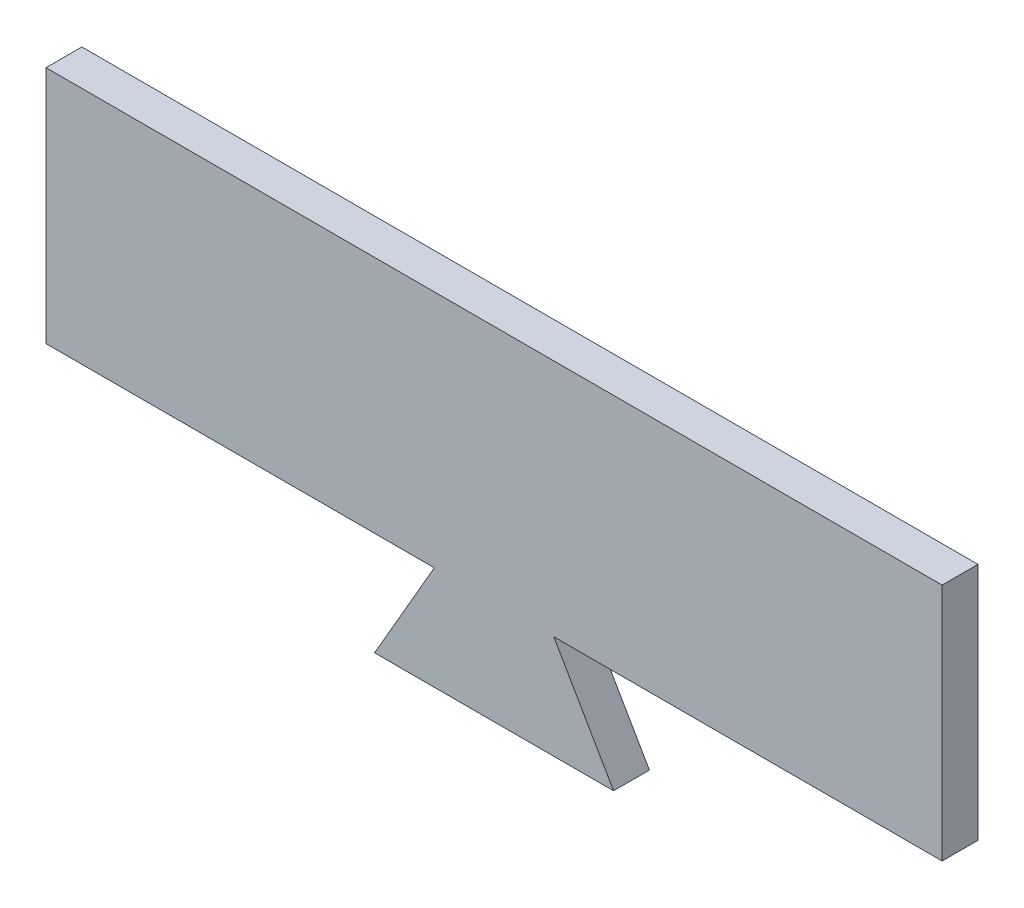
ISO-10303-21;
HEADER;
FILE_DESCRIPTION(('STEP AP214'),'2;1');
FILE_NAME('part.step','',(''),(''),'','','');
FILE_SCHEMA(('AUTOMOTIVE_DESIGN { 1 0 10303 214 1 1 1 1 }'));
ENDSEC;
DATA;
#1=APPLICATION_CONTEXT('core data for automotive mechanical design processes');
#2=APPLICATION_PROTOCOL_DEFINITION('international standard','automotive_design',2000,#1);
#3=PRODUCT_CONTEXT('',#1,'mechanical');
#4=PRODUCT('Part','Part','',(#3));
#5=PRODUCT_RELATED_PRODUCT_CATEGORY('part','',(#4));
#6=PRODUCT_DEFINITION_FORMATION('','',#4);
#7=PRODUCT_DEFINITION_CONTEXT('part definition',#1,'design');
#8=PRODUCT_DEFINITION('design','',#6,#7);
#9=PRODUCT_DEFINITION_SHAPE('','',#8);
#10=(LENGTH_UNIT() NAMED_UNIT(*) SI_UNIT(.MILLI.,.METRE.));
#11=(NAMED_UNIT(*) PLANE_ANGLE_UNIT() SI_UNIT($,.RADIAN.));
#12=(NAMED_UNIT(*) SI_UNIT($,.STERADIAN.) SOLID_ANGLE_UNIT());
#13=UNCERTAINTY_MEASURE_WITH_UNIT(LENGTH_MEASURE(1.E-05),#10,'distance_accuracy_value','');
#14=(GEOMETRIC_REPRESENTATION_CONTEXT(3) GLOBAL_UNCERTAINTY_ASSIGNED_CONTEXT((#13)) GLOBAL_UNIT_ASSIGNED_CONTEXT((#10,
#11,#12)) REPRESENTATION_CONTEXT('',''));
#15=CARTESIAN_POINT('',(0.,0.,0.));
#16=DIRECTION('',(0.,0.,1.));
#17=DIRECTION('',(1.,0.,0.));
#18=AXIS2_PLACEMENT_3D('',#15,#16,#17);
#19=CARTESIAN_POINT('',(-15.0390611199178,34.2018029754163,6.));
#20=DIRECTION('',(0.,-1.,0.));
#21=DIRECTION('',(1.,0.,0.));
#22=AXIS2_PLACEMENT_3D('',#19,#20,#21);
#23=PLANE('',#22);
#24=DIRECTION('',(-1.,0.,0.));
#25=VECTOR('',#24,1.);
#26=CARTESIAN_POINT('',(-15.0390611199178,34.2018029754163,0.));
#27=LINE('',#26,#25);
#28=CARTESIAN_POINT('',(-15.0390611199178,34.2018029754163,0.));
#29=VERTEX_POINT('',#28);
#30=CARTESIAN_POINT('',(-80.0390611199176,34.2018029754162,0.));
#31=VERTEX_POINT('',#30);
#32=EDGE_CURVE('E130',#29,#31,#27,.T.);
#33=ORIENTED_EDGE('',*,*,#32,.F.);
#34=DIRECTION('',(0.,0.,-1.));
#35=VECTOR('',#34,1.);
#36=CARTESIAN_POINT('',(-15.0390611199178,34.2018029754163,6.));
#37=LINE('',#36,#35);
#38=CARTESIAN_POINT('',(-15.0390611199178,34.2018029754163,6.));
#39=VERTEX_POINT('',#38);
#40=EDGE_CURVE('E11',#39,#29,#37,.T.);
#41=ORIENTED_EDGE('',*,*,#40,.F.);
#42=DIRECTION('',(-1.,0.,0.));
#43=VECTOR('',#42,1.);
#44=CARTESIAN_POINT('',(-15.0390611199178,34.2018029754163,6.));
#45=LINE('',#44,#43);
#46=CARTESIAN_POINT('',(-80.0390611199176,34.2018029754162,6.));
#47=VERTEX_POINT('',#46);
#48=EDGE_CURVE('E150',#39,#47,#45,.T.);
#49=ORIENTED_EDGE('',*,*,#48,.T.);
#50=DIRECTION('',(0.,0.,-1.));
#51=VECTOR('',#50,1.);
#52=CARTESIAN_POINT('',(-80.0390611199176,34.2018029754162,6.));
#53=LINE('',#52,#51);
#54=EDGE_CURVE('E36',#47,#31,#53,.T.);
#55=ORIENTED_EDGE('',*,*,#54,.T.);
#56=EDGE_LOOP('',(#33,#41,#49,#55));
#57=FACE_BOUND('',#56,.T.);
#58=ADVANCED_FACE('F33',(#57),#23,.T.);
#59=CARTESIAN_POINT('',(-25.0390611199178,16.8812948997275,6.));
#60=DIRECTION('',(-0.866025403784439,0.499999999999999,0.));
#61=DIRECTION('',(-0.499999999999999,-0.866025403784439,0.));
#62=AXIS2_PLACEMENT_3D('',#59,#60,#61);
#63=PLANE('',#62);
#64=DIRECTION('',(0.499999999999999,0.866025403784439,0.));
#65=VECTOR('',#64,1.);
#66=CARTESIAN_POINT('',(-25.0390611199178,16.8812948997275,0.));
#67=LINE('',#66,#65);
#68=CARTESIAN_POINT('',(-25.0390611199178,16.8812948997275,0.));
#69=VERTEX_POINT('',#68);
#70=EDGE_CURVE('E148',#69,#29,#67,.T.);
#71=ORIENTED_EDGE('',*,*,#70,.F.);
#72=DIRECTION('',(0.,0.,-1.));
#73=VECTOR('',#72,1.);
#74=CARTESIAN_POINT('',(-25.0390611199178,16.8812948997275,6.));
#75=LINE('',#74,#73);
#76=CARTESIAN_POINT('',(-25.0390611199178,16.8812948997275,6.));
#77=VERTEX_POINT('',#76);
#78=EDGE_CURVE('E42',#77,#69,#75,.T.);
#79=ORIENTED_EDGE('',*,*,#78,.F.);
#80=DIRECTION('',(0.499999999999999,0.866025403784439,0.));
#81=VECTOR('',#80,1.);
#82=CARTESIAN_POINT('',(-25.0390611199178,16.8812948997275,6.));
#83=LINE('',#82,#81);
#84=EDGE_CURVE('E120',#77,#39,#83,.T.);
#85=ORIENTED_EDGE('',*,*,#84,.T.);
#86=ORIENTED_EDGE('',*,*,#40,.T.);
#87=EDGE_LOOP('',(#71,#79,#85,#86));
#88=FACE_BOUND('',#87,.T.);
#89=ADVANCED_FACE('F162',(#88),#63,.T.);
#90=CARTESIAN_POINT('',(14.9609388800822,16.8812948997275,6.));
#91=DIRECTION('',(0.,-1.,0.));
#92=DIRECTION('',(1.,0.,0.));
#93=AXIS2_PLACEMENT_3D('',#90,#91,#92);
#94=PLANE('',#93);
#95=DIRECTION('',(-1.,0.,0.));
#96=VECTOR('',#95,1.);
#97=CARTESIAN_POINT('',(14.9609388800822,16.8812948997275,0.));
#98=LINE('',#97,#96);
#99=CARTESIAN_POINT('',(14.9609388800822,16.8812948997275,0.));
#100=VERTEX_POINT('',#99);
#101=EDGE_CURVE('E107',#100,#69,#98,.T.);
#102=ORIENTED_EDGE('',*,*,#101,.F.);
#103=DIRECTION('',(0.,0.,-1.));
#104=VECTOR('',#103,1.);
#105=CARTESIAN_POINT('',(14.9609388800822,16.8812948997275,6.));
#106=LINE('',#105,#104);
#107=CARTESIAN_POINT('',(14.9609388800822,16.8812948997275,6.));
#108=VERTEX_POINT('',#107);
#109=EDGE_CURVE('E102',#108,#100,#106,.T.);
#110=ORIENTED_EDGE('',*,*,#109,.F.);
#111=DIRECTION('',(-1.,0.,0.));
#112=VECTOR('',#111,1.);
#113=CARTESIAN_POINT('',(14.9609388800822,16.8812948997275,6.));
#114=LINE('',#113,#112);
#115=EDGE_CURVE('E105',#108,#77,#114,.T.);
#116=ORIENTED_EDGE('',*,*,#115,.T.);
#117=ORIENTED_EDGE('',*,*,#78,.T.);
#118=EDGE_LOOP('',(#102,#110,#116,#117));
#119=FACE_BOUND('',#118,.T.);
#120=ADVANCED_FACE('F104',(#119),#94,.T.);
#121=CARTESIAN_POINT('',(4.96093888008223,34.2018029754162,6.));
#122=DIRECTION('',(0.866025403784438,0.500000000000001,0.));
#123=DIRECTION('',(-0.500000000000001,0.866025403784438,0.));
#124=AXIS2_PLACEMENT_3D('',#121,#122,#123);
#125=PLANE('',#124);
#126=DIRECTION('',(0.500000000000001,-0.866025403784438,0.));
#127=VECTOR('',#126,1.);
#128=CARTESIAN_POINT('',(4.96093888008223,34.2018029754162,0.));
#129=LINE('',#128,#127);
#130=CARTESIAN_POINT('',(4.96093888008223,34.2018029754162,0.));
#131=VERTEX_POINT('',#130);
#132=EDGE_CURVE('E145',#131,#100,#129,.T.);
#133=ORIENTED_EDGE('',*,*,#132,.F.);
#134=DIRECTION('',(0.,0.,-1.));
#135=VECTOR('',#134,1.);
#136=CARTESIAN_POINT('',(4.96093888008223,34.2018029754162,6.));
#137=LINE('',#136,#135);
#138=CARTESIAN_POINT('',(4.96093888008223,34.2018029754162,6.));
#139=VERTEX_POINT('',#138);
#140=EDGE_CURVE('E112',#139,#131,#137,.T.);
#141=ORIENTED_EDGE('',*,*,#140,.F.);
#142=DIRECTION('',(0.500000000000001,-0.866025403784438,0.));
#143=VECTOR('',#142,1.);
#144=CARTESIAN_POINT('',(4.96093888008223,34.2018029754162,6.));
#145=LINE('',#144,#143);
#146=EDGE_CURVE('E118',#139,#108,#145,.T.);
#147=ORIENTED_EDGE('',*,*,#146,.T.);
#148=ORIENTED_EDGE('',*,*,#109,.T.);
#149=EDGE_LOOP('',(#133,#141,#147,#148));
#150=FACE_BOUND('',#149,.T.);
#151=ADVANCED_FACE('F122',(#150),#125,.T.);
#152=CARTESIAN_POINT('',(69.9609388800822,34.2018029754163,6.));
#153=DIRECTION('',(0.,-1.,0.));
#154=DIRECTION('',(1.,0.,0.));
#155=AXIS2_PLACEMENT_3D('',#152,#153,#154);
#156=PLANE('',#155);
#157=DIRECTION('',(-1.,0.,0.));
#158=VECTOR('',#157,1.);
#159=CARTESIAN_POINT('',(69.9609388800822,34.2018029754163,0.));
#160=LINE('',#159,#158);
#161=CARTESIAN_POINT('',(69.9609388800822,34.2018029754163,0.));
#162=VERTEX_POINT('',#161);
#163=EDGE_CURVE('E142',#162,#131,#160,.T.);
#164=ORIENTED_EDGE('',*,*,#163,.F.);
#165=DIRECTION('',(0.,0.,-1.));
#166=VECTOR('',#165,1.);
#167=CARTESIAN_POINT('',(69.9609388800822,34.2018029754163,6.));
#168=LINE('',#167,#166);
#169=CARTESIAN_POINT('',(69.9609388800822,34.2018029754163,6.));
#170=VERTEX_POINT('',#169);
#171=EDGE_CURVE('E154',#170,#162,#168,.T.);
#172=ORIENTED_EDGE('',*,*,#171,.F.);
#173=DIRECTION('',(-1.,0.,0.));
#174=VECTOR('',#173,1.);
#175=CARTESIAN_POINT('',(69.9609388800822,34.2018029754163,6.));
#176=LINE('',#175,#174);
#177=EDGE_CURVE('E123',#170,#139,#176,.T.);
#178=ORIENTED_EDGE('',*,*,#177,.T.);
#179=ORIENTED_EDGE('',*,*,#140,.T.);
#180=EDGE_LOOP('',(#164,#172,#178,#179));
#181=FACE_BOUND('',#180,.T.);
#182=ADVANCED_FACE('F175',(#181),#156,.T.);
#183=CARTESIAN_POINT('',(69.9609388800822,74.2018029754163,6.));
#184=DIRECTION('',(1.,0.,0.));
#185=DIRECTION('',(0.,1.,0.));
#186=AXIS2_PLACEMENT_3D('',#183,#184,#185);
#187=PLANE('',#186);
#188=DIRECTION('',(0.,-1.,0.));
#189=VECTOR('',#188,1.);
#190=CARTESIAN_POINT('',(69.9609388800822,74.2018029754163,0.));
#191=LINE('',#190,#189);
#192=CARTESIAN_POINT('',(69.9609388800822,74.2018029754163,0.));
#193=VERTEX_POINT('',#192);
#194=EDGE_CURVE('E139',#193,#162,#191,.T.);
#195=ORIENTED_EDGE('',*,*,#194,.F.);
#196=DIRECTION('',(0.,0.,-1.));
#197=VECTOR('',#196,1.);
#198=CARTESIAN_POINT('',(69.9609388800822,74.2018029754163,6.));
#199=LINE('',#198,#197);
#200=CARTESIAN_POINT('',(69.9609388800822,74.2018029754163,6.));
#201=VERTEX_POINT('',#200);
#202=EDGE_CURVE('E156',#201,#193,#199,.T.);
#203=ORIENTED_EDGE('',*,*,#202,.F.);
#204=DIRECTION('',(0.,-1.,0.));
#205=VECTOR('',#204,1.);
#206=CARTESIAN_POINT('',(69.9609388800822,74.2018029754163,6.));
#207=LINE('',#206,#205);
#208=EDGE_CURVE('E125',#201,#170,#207,.T.);
#209=ORIENTED_EDGE('',*,*,#208,.T.);
#210=ORIENTED_EDGE('',*,*,#171,.T.);
#211=EDGE_LOOP('',(#195,#203,#209,#210));
#212=FACE_BOUND('',#211,.T.);
#213=ADVANCED_FACE('F178',(#212),#187,.T.);
#214=CARTESIAN_POINT('',(-80.0390611199178,74.2018029754163,6.));
#215=DIRECTION('',(0.,1.,0.));
#216=DIRECTION('',(0.,0.,1.));
#217=AXIS2_PLACEMENT_3D('',#214,#215,#216);
#218=PLANE('',#217);
#219=DIRECTION('',(1.,0.,0.));
#220=VECTOR('',#219,1.);
#221=CARTESIAN_POINT('',(-80.0390611199178,74.2018029754163,0.));
#222=LINE('',#221,#220);
#223=CARTESIAN_POINT('',(-80.0390611199178,74.2018029754163,0.));
#224=VERTEX_POINT('',#223);
#225=EDGE_CURVE('E136',#224,#193,#222,.T.);
#226=ORIENTED_EDGE('',*,*,#225,.F.);
#227=DIRECTION('',(0.,0.,-1.));
#228=VECTOR('',#227,1.);
#229=CARTESIAN_POINT('',(-80.0390611199178,74.2018029754163,6.));
#230=LINE('',#229,#228);
#231=CARTESIAN_POINT('',(-80.0390611199178,74.2018029754163,6.));
#232=VERTEX_POINT('',#231);
#233=EDGE_CURVE('E157',#232,#224,#230,.T.);
#234=ORIENTED_EDGE('',*,*,#233,.F.);
#235=DIRECTION('',(1.,0.,0.));
#236=VECTOR('',#235,1.);
#237=CARTESIAN_POINT('',(-80.0390611199178,74.2018029754163,6.));
#238=LINE('',#237,#236);
#239=EDGE_CURVE('E253',#232,#201,#238,.T.);
#240=ORIENTED_EDGE('',*,*,#239,.T.);
#241=ORIENTED_EDGE('',*,*,#202,.T.);
#242=EDGE_LOOP('',(#226,#234,#240,#241));
#243=FACE_BOUND('',#242,.T.);
#244=ADVANCED_FACE('F182',(#243),#218,.T.);
#245=CARTESIAN_POINT('',(-80.0390611199176,34.2018029754162,6.));
#246=DIRECTION('',(-1.,0.,0.));
#247=DIRECTION('',(0.,-1.,0.));
#248=AXIS2_PLACEMENT_3D('',#245,#246,#247);
#249=PLANE('',#248);
#250=DIRECTION('',(0.,1.,0.));
#251=VECTOR('',#250,1.);
#252=CARTESIAN_POINT('',(-80.0390611199176,34.2018029754162,0.));
#253=LINE('',#252,#251);
#254=EDGE_CURVE('E133',#31,#224,#253,.T.);
#255=ORIENTED_EDGE('',*,*,#254,.F.);
#256=ORIENTED_EDGE('',*,*,#54,.F.);
#257=DIRECTION('',(0.,1.,0.));
#258=VECTOR('',#257,1.);
#259=CARTESIAN_POINT('',(-80.0390611199176,34.2018029754162,6.));
#260=LINE('',#259,#258);
#261=EDGE_CURVE('E254',#47,#232,#260,.T.);
#262=ORIENTED_EDGE('',*,*,#261,.T.);
#263=ORIENTED_EDGE('',*,*,#233,.T.);
#264=EDGE_LOOP('',(#255,#256,#262,#263));
#265=FACE_BOUND('',#264,.T.);
#266=ADVANCED_FACE('F159',(#265),#249,.T.);
#267=CARTESIAN_POINT('',(0.,0.,6.));
#268=DIRECTION('',(0.,0.,-1.));
#269=DIRECTION('',(-1.,0.,0.));
#270=AXIS2_PLACEMENT_3D('',#267,#268,#269);
#271=PLANE('',#270);
#272=ORIENTED_EDGE('',*,*,#48,.F.);
#273=ORIENTED_EDGE('',*,*,#84,.F.);
#274=ORIENTED_EDGE('',*,*,#115,.F.);
#275=ORIENTED_EDGE('',*,*,#146,.F.);
#276=ORIENTED_EDGE('',*,*,#177,.F.);
#277=ORIENTED_EDGE('',*,*,#208,.F.);
#278=ORIENTED_EDGE('',*,*,#239,.F.);
#279=ORIENTED_EDGE('',*,*,#261,.F.);
#280=EDGE_LOOP('',(#272,#273,#274,#275,#276,#277,#278,#279));
#281=FACE_BOUND('',#280,.T.);
#282=ADVANCED_FACE('F116',(#281),#271,.F.);
#283=CARTESIAN_POINT('',(0.,0.,0.));
#284=DIRECTION('',(0.,0.,-1.));
#285=DIRECTION('',(-1.,0.,0.));
#286=AXIS2_PLACEMENT_3D('',#283,#284,#285);
#287=PLANE('',#286);
#288=ORIENTED_EDGE('',*,*,#32,.T.);
#289=ORIENTED_EDGE('',*,*,#254,.T.);
#290=ORIENTED_EDGE('',*,*,#225,.T.);
#291=ORIENTED_EDGE('',*,*,#194,.T.);
#292=ORIENTED_EDGE('',*,*,#163,.T.);
#293=ORIENTED_EDGE('',*,*,#132,.T.);
#294=ORIENTED_EDGE('',*,*,#101,.T.);
#295=ORIENTED_EDGE('',*,*,#70,.T.);
#296=EDGE_LOOP('',(#288,#289,#290,#291,#292,#293,#294,#295));
#297=FACE_BOUND('',#296,.T.);
#298=ADVANCED_FACE('F161',(#297),#287,.T.);
#299=CLOSED_SHELL('',(#58,#89,#120,#151,#182,#213,#244,#266,#282,#298));
#300=MANIFOLD_SOLID_BREP('B2',#299);
#301=ADVANCED_BREP_SHAPE_REPRESENTATION('',(#18,#300),#14);
#302=SHAPE_DEFINITION_REPRESENTATION(#9,#301);
ENDSEC;
END-ISO-10303-21;
